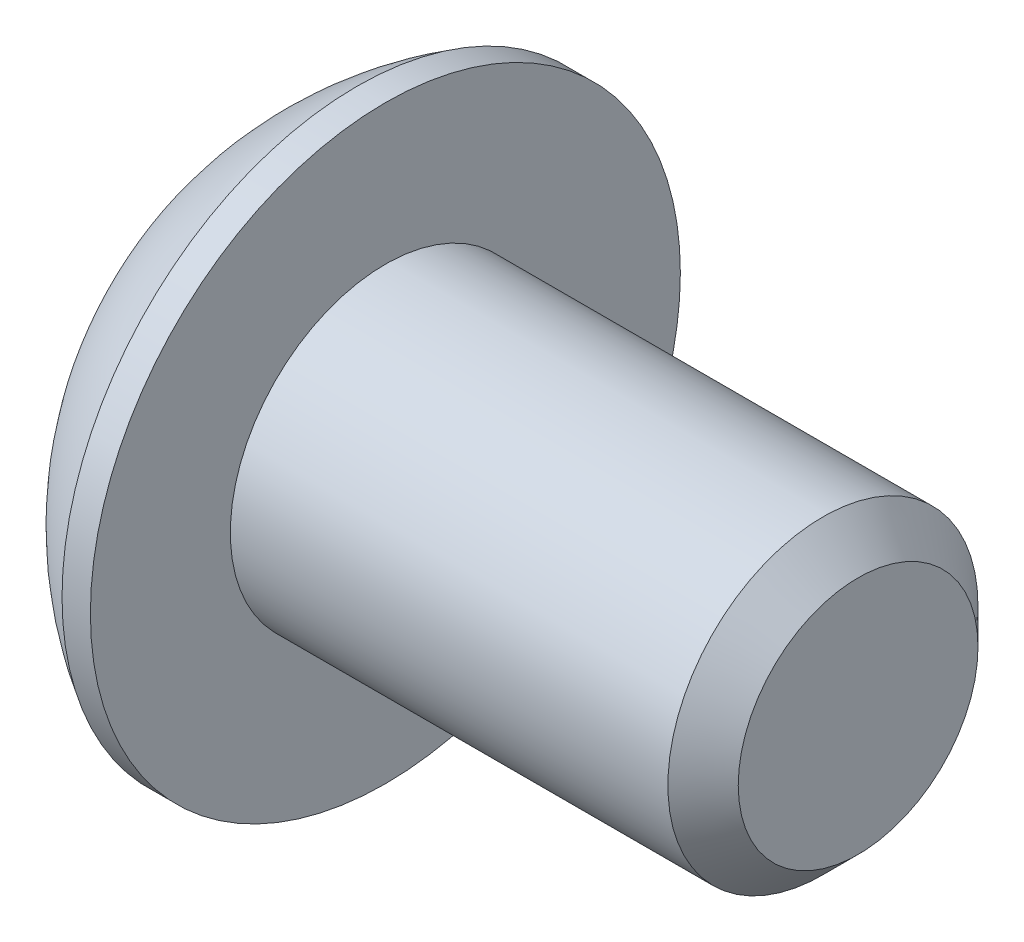
ISO-10303-21;
HEADER;
FILE_DESCRIPTION(('STEP AP214'),'2;1');
FILE_NAME('part.step','',(''),(''),'','','');
FILE_SCHEMA(('AUTOMOTIVE_DESIGN { 1 0 10303 214 1 1 1 1 }'));
ENDSEC;
DATA;
#1=APPLICATION_CONTEXT('core data for automotive mechanical design processes');
#2=APPLICATION_PROTOCOL_DEFINITION('international standard','automotive_design',2000,#1);
#3=PRODUCT_CONTEXT('',#1,'mechanical');
#4=PRODUCT('Part','Part','',(#3));
#5=PRODUCT_RELATED_PRODUCT_CATEGORY('part','',(#4));
#6=PRODUCT_DEFINITION_FORMATION('','',#4);
#7=PRODUCT_DEFINITION_CONTEXT('part definition',#1,'design');
#8=PRODUCT_DEFINITION('design','',#6,#7);
#9=PRODUCT_DEFINITION_SHAPE('','',#8);
#10=(LENGTH_UNIT() NAMED_UNIT(*) SI_UNIT(.MILLI.,.METRE.));
#11=(NAMED_UNIT(*) PLANE_ANGLE_UNIT() SI_UNIT($,.RADIAN.));
#12=(NAMED_UNIT(*) SI_UNIT($,.STERADIAN.) SOLID_ANGLE_UNIT());
#13=UNCERTAINTY_MEASURE_WITH_UNIT(LENGTH_MEASURE(1.E-05),#10,'distance_accuracy_value','');
#14=(GEOMETRIC_REPRESENTATION_CONTEXT(3) GLOBAL_UNCERTAINTY_ASSIGNED_CONTEXT((#13)) GLOBAL_UNIT_ASSIGNED_CONTEXT((#10,
#11,#12)) REPRESENTATION_CONTEXT('',''));
#15=CARTESIAN_POINT('',(0.,0.,0.));
#16=DIRECTION('',(0.,0.,1.));
#17=DIRECTION('',(1.,0.,0.));
#18=AXIS2_PLACEMENT_3D('',#15,#16,#17);
#19=CARTESIAN_POINT('',(8.55980000000001,0.,0.));
#20=DIRECTION('',(-1.,0.,0.));
#21=DIRECTION('',(0.,0.,-1.));
#22=AXIS2_PLACEMENT_3D('',#19,#20,#21);
#23=PLANE('',#22);
#24=CARTESIAN_POINT('',(8.55979999994361,0.,0.));
#25=DIRECTION('',(1.,0.,0.));
#26=DIRECTION('',(0.,0.,-1.));
#27=AXIS2_PLACEMENT_3D('',#24,#25,#26);
#28=CIRCLE('',#27,1.61036000008604);
#29=CARTESIAN_POINT('',(8.55979999994361,0.,-1.61036000008608));
#30=VERTEX_POINT('',#29);
#31=EDGE_CURVE('E41',#30,#30,#28,.T.);
#32=ORIENTED_EDGE('',*,*,#31,.T.);
#33=EDGE_LOOP('',(#32));
#34=FACE_BOUND('',#33,.T.);
#35=ADVANCED_FACE('F37',(#34),#23,.F.);
#36=CARTESIAN_POINT('',(8.08735999999044,0.,0.));
#37=DIRECTION('',(-1.,0.,0.));
#38=DIRECTION('',(0.,0.,-1.));
#39=AXIS2_PLACEMENT_3D('',#36,#37,#38);
#40=CONICAL_SURFACE('',#39,2.08280000003921,0.785398163397448);
#41=ORIENTED_EDGE('',*,*,#31,.F.);
#42=EDGE_LOOP('',(#41));
#43=FACE_BOUND('',#42,.T.);
#44=CARTESIAN_POINT('',(8.08735999999999,0.,0.));
#45=DIRECTION('',(1.,0.,0.));
#46=DIRECTION('',(0.,0.,-1.));
#47=AXIS2_PLACEMENT_3D('',#44,#45,#46);
#48=CIRCLE('',#47,2.08280000000002);
#49=CARTESIAN_POINT('',(8.08735999999999,0.,-2.08280000000002));
#50=VERTEX_POINT('',#49);
#51=EDGE_CURVE('E145',#50,#50,#48,.T.);
#52=ORIENTED_EDGE('',*,*,#51,.T.);
#53=EDGE_LOOP('',(#52));
#54=FACE_BOUND('',#53,.T.);
#55=ADVANCED_FACE('F294',(#43,#54),#40,.T.);
#56=CARTESIAN_POINT('',(1.32079999991674,0.,0.));
#57=DIRECTION('',(-1.,0.,0.));
#58=DIRECTION('',(0.,0.,-1.));
#59=AXIS2_PLACEMENT_3D('',#56,#57,#58);
#60=CONICAL_SURFACE('',#59,1.19380000000998,1.04719755121067);
#61=CARTESIAN_POINT('',(2.01004075125866,0.,0.));
#62=VERTEX_POINT('',#61);
#63=VERTEX_LOOP('',#62);
#64=FACE_BOUND('',#63,.T.);
#65=CARTESIAN_POINT('',(1.32079999991674,0.,0.));
#66=DIRECTION('',(1.,0.,0.));
#67=DIRECTION('',(0.,0.,-1.));
#68=AXIS2_PLACEMENT_3D('',#65,#66,#67);
#69=CIRCLE('',#68,1.19380000000998);
#70=CARTESIAN_POINT('',(1.32079999995841,-1.03386112704217,-0.596900000002525));
#71=VERTEX_POINT('',#70);
#72=CARTESIAN_POINT('',(1.32079999995191,0.,-1.19379999997911));
#73=VERTEX_POINT('',#72);
#74=EDGE_CURVE('E139',#71,#73,#69,.T.);
#75=ORIENTED_EDGE('',*,*,#74,.F.);
#76=CARTESIAN_POINT('',(1.32079999991674,0.,0.));
#77=DIRECTION('',(1.,0.,0.));
#78=DIRECTION('',(0.,0.,-1.));
#79=AXIS2_PLACEMENT_3D('',#76,#77,#78);
#80=CIRCLE('',#79,1.19380000000998);
#81=CARTESIAN_POINT('',(1.3207999999586,-1.03386112704217,0.596900000002466));
#82=VERTEX_POINT('',#81);
#83=EDGE_CURVE('E150',#82,#71,#80,.T.);
#84=ORIENTED_EDGE('',*,*,#83,.F.);
#85=CARTESIAN_POINT('',(1.32079999991674,0.,0.));
#86=DIRECTION('',(1.,0.,0.));
#87=DIRECTION('',(0.,0.,-1.));
#88=AXIS2_PLACEMENT_3D('',#85,#86,#87);
#89=CIRCLE('',#88,1.19380000000998);
#90=CARTESIAN_POINT('',(1.32079999995838,1.49000099134676E-12,1.19380000000498));
#91=VERTEX_POINT('',#90);
#92=EDGE_CURVE('E153',#91,#82,#89,.T.);
#93=ORIENTED_EDGE('',*,*,#92,.F.);
#94=CARTESIAN_POINT('',(1.32079999991674,0.,0.));
#95=DIRECTION('',(1.,0.,0.));
#96=DIRECTION('',(0.,0.,-1.));
#97=AXIS2_PLACEMENT_3D('',#94,#95,#96);
#98=CIRCLE('',#97,1.19380000000998);
#99=CARTESIAN_POINT('',(1.3207999999586,1.03386112704219,0.596900000002484));
#100=VERTEX_POINT('',#99);
#101=EDGE_CURVE('E144',#100,#91,#98,.T.);
#102=ORIENTED_EDGE('',*,*,#101,.F.);
#103=CARTESIAN_POINT('',(1.32079999991674,0.,0.));
#104=DIRECTION('',(1.,0.,0.));
#105=DIRECTION('',(0.,0.,-1.));
#106=AXIS2_PLACEMENT_3D('',#103,#104,#105);
#107=CIRCLE('',#106,1.19380000000998);
#108=CARTESIAN_POINT('',(1.32079999995841,1.03386112704219,-0.596900000002536));
#109=VERTEX_POINT('',#108);
#110=EDGE_CURVE('E126',#109,#100,#107,.T.);
#111=ORIENTED_EDGE('',*,*,#110,.F.);
#112=CARTESIAN_POINT('',(1.32079999991674,0.,0.));
#113=DIRECTION('',(1.,0.,0.));
#114=DIRECTION('',(0.,0.,-1.));
#115=AXIS2_PLACEMENT_3D('',#112,#113,#114);
#116=CIRCLE('',#115,1.19380000000998);
#117=EDGE_CURVE('E133',#73,#109,#116,.T.);
#118=ORIENTED_EDGE('',*,*,#117,.F.);
#119=EDGE_LOOP('',(#75,#84,#93,#102,#111,#118));
#120=FACE_BOUND('',#119,.T.);
#121=ADVANCED_FACE('F141',(#64,#120),#60,.F.);
#122=CARTESIAN_POINT('',(0.,0.,0.));
#123=DIRECTION('',(-1.,0.,0.));
#124=DIRECTION('',(0.,0.,-1.));
#125=AXIS2_PLACEMENT_3D('',#122,#123,#124);
#126=CYLINDRICAL_SURFACE('',#125,2.08280000000002);
#127=ORIENTED_EDGE('',*,*,#51,.F.);
#128=EDGE_LOOP('',(#127));
#129=FACE_BOUND('',#128,.T.);
#130=CARTESIAN_POINT('',(2.20979999999998,0.,0.));
#131=DIRECTION('',(1.,0.,0.));
#132=DIRECTION('',(0.,0.,-1.));
#133=AXIS2_PLACEMENT_3D('',#130,#131,#132);
#134=CIRCLE('',#133,2.08280000000002);
#135=CARTESIAN_POINT('',(2.20979999999998,0.,-2.08280000000002));
#136=VERTEX_POINT('',#135);
#137=EDGE_CURVE('E157',#136,#136,#134,.F.);
#138=ORIENTED_EDGE('',*,*,#137,.F.);
#139=EDGE_LOOP('',(#138));
#140=FACE_BOUND('',#139,.T.);
#141=ADVANCED_FACE('F305',(#129,#140),#126,.T.);
#142=CARTESIAN_POINT('',(1.32080000000001,-2.06772225407572,1.19379999999998));
#143=DIRECTION('',(1.,0.,0.));
#144=DIRECTION('',(0.,0.,1.));
#145=AXIS2_PLACEMENT_3D('',#142,#143,#144);
#146=PLANE('',#145);
#147=DIRECTION('',(0.,-0.5,0.866025403784439));
#148=VECTOR('',#147,1.);
#149=CARTESIAN_POINT('',(1.32080000000045,1.37848150271718,0.));
#150=LINE('',#149,#148);
#151=CARTESIAN_POINT('',(1.32080000000016,1.37848150271718,0.));
#152=VERTEX_POINT('',#151);
#153=EDGE_CURVE('E129',#100,#152,#150,.F.);
#154=ORIENTED_EDGE('',*,*,#153,.T.);
#155=DIRECTION('',(0.,0.5,0.866025403784438));
#156=VECTOR('',#155,1.);
#157=CARTESIAN_POINT('',(1.32080000000001,0.68924075135858,-1.19380000000002));
#158=LINE('',#157,#156);
#159=EDGE_CURVE('E112',#152,#109,#158,.F.);
#160=ORIENTED_EDGE('',*,*,#159,.T.);
#161=ORIENTED_EDGE('',*,*,#110,.T.);
#162=EDGE_LOOP('',(#154,#160,#161));
#163=FACE_BOUND('',#162,.T.);
#164=ADVANCED_FACE('F124',(#163),#146,.F.);
#165=CARTESIAN_POINT('',(1.32080000000001,-2.06772225407572,1.19379999999998));
#166=DIRECTION('',(1.,0.,0.));
#167=DIRECTION('',(0.,0.,1.));
#168=AXIS2_PLACEMENT_3D('',#165,#166,#167);
#169=PLANE('',#168);
#170=DIRECTION('',(0.,0.5,0.866025403784438));
#171=VECTOR('',#170,1.);
#172=CARTESIAN_POINT('',(1.32080000000007,0.68924075135858,-1.19380000000002));
#173=LINE('',#172,#171);
#174=CARTESIAN_POINT('',(1.32080000000028,0.6892407513586,-1.19380000000003));
#175=VERTEX_POINT('',#174);
#176=EDGE_CURVE('E108',#109,#175,#173,.F.);
#177=ORIENTED_EDGE('',*,*,#176,.T.);
#178=DIRECTION('',(0.,1.,0.));
#179=VECTOR('',#178,1.);
#180=CARTESIAN_POINT('',(1.32080000000051,-0.689240751358577,-1.19380000000003));
#181=LINE('',#180,#179);
#182=EDGE_CURVE('E135',#175,#73,#181,.F.);
#183=ORIENTED_EDGE('',*,*,#182,.T.);
#184=ORIENTED_EDGE('',*,*,#117,.T.);
#185=EDGE_LOOP('',(#177,#183,#184));
#186=FACE_BOUND('',#185,.T.);
#187=ADVANCED_FACE('F134',(#186),#169,.F.);
#188=CARTESIAN_POINT('',(1.32080000000001,-2.06772225407572,1.19379999999998));
#189=DIRECTION('',(1.,0.,0.));
#190=DIRECTION('',(0.,0.,1.));
#191=AXIS2_PLACEMENT_3D('',#188,#189,#190);
#192=PLANE('',#191);
#193=DIRECTION('',(0.,1.,0.));
#194=VECTOR('',#193,1.);
#195=CARTESIAN_POINT('',(1.32080000000057,-0.689240751358577,-1.19380000000003));
#196=LINE('',#195,#194);
#197=CARTESIAN_POINT('',(1.32080000000045,-0.689240751358574,-1.19380000000003));
#198=VERTEX_POINT('',#197);
#199=EDGE_CURVE('E193',#73,#198,#196,.F.);
#200=ORIENTED_EDGE('',*,*,#199,.T.);
#201=DIRECTION('',(0.,0.5,-0.866025403784439));
#202=VECTOR('',#201,1.);
#203=CARTESIAN_POINT('',(1.32080000000051,-1.37848150271714,0.));
#204=LINE('',#203,#202);
#205=EDGE_CURVE('E207',#198,#71,#204,.F.);
#206=ORIENTED_EDGE('',*,*,#205,.T.);
#207=ORIENTED_EDGE('',*,*,#74,.T.);
#208=EDGE_LOOP('',(#200,#206,#207));
#209=FACE_BOUND('',#208,.T.);
#210=ADVANCED_FACE('F314',(#209),#192,.F.);
#211=CARTESIAN_POINT('',(1.32080000000001,-2.06772225407572,1.19379999999998));
#212=DIRECTION('',(1.,0.,0.));
#213=DIRECTION('',(0.,0.,1.));
#214=AXIS2_PLACEMENT_3D('',#211,#212,#213);
#215=PLANE('',#214);
#216=DIRECTION('',(0.,0.5,-0.866025403784439));
#217=VECTOR('',#216,1.);
#218=CARTESIAN_POINT('',(1.32080000000007,-1.37848150271714,0.));
#219=LINE('',#218,#217);
#220=CARTESIAN_POINT('',(1.32080000000003,-1.37848150271713,0.));
#221=VERTEX_POINT('',#220);
#222=EDGE_CURVE('E212',#71,#221,#219,.F.);
#223=ORIENTED_EDGE('',*,*,#222,.T.);
#224=DIRECTION('',(0.,-0.5,-0.866025403784439));
#225=VECTOR('',#224,1.);
#226=CARTESIAN_POINT('',(1.32080000000001,-0.689240751358577,1.19379999999997));
#227=LINE('',#226,#225);
#228=EDGE_CURVE('E226',#221,#82,#227,.F.);
#229=ORIENTED_EDGE('',*,*,#228,.T.);
#230=ORIENTED_EDGE('',*,*,#83,.T.);
#231=EDGE_LOOP('',(#223,#229,#230));
#232=FACE_BOUND('',#231,.T.);
#233=ADVANCED_FACE('F273',(#232),#215,.F.);
#234=CARTESIAN_POINT('',(1.32080000000001,-2.06772225407572,1.19379999999998));
#235=DIRECTION('',(1.,0.,0.));
#236=DIRECTION('',(0.,0.,1.));
#237=AXIS2_PLACEMENT_3D('',#234,#235,#236);
#238=PLANE('',#237);
#239=DIRECTION('',(0.,-0.5,-0.866025403784439));
#240=VECTOR('',#239,1.);
#241=CARTESIAN_POINT('',(1.32080000000045,-0.689240751358577,1.19379999999997));
#242=LINE('',#241,#240);
#243=CARTESIAN_POINT('',(1.32080000000016,-0.689240751358563,1.19379999999999));
#244=VERTEX_POINT('',#243);
#245=EDGE_CURVE('E231',#82,#244,#242,.F.);
#246=ORIENTED_EDGE('',*,*,#245,.T.);
#247=DIRECTION('',(0.,1.,0.));
#248=VECTOR('',#247,1.);
#249=CARTESIAN_POINT('',(1.32080000000001,0.689240751358615,1.19380000000001));
#250=LINE('',#249,#248);
#251=EDGE_CURVE('E247',#244,#91,#250,.T.);
#252=ORIENTED_EDGE('',*,*,#251,.T.);
#253=ORIENTED_EDGE('',*,*,#92,.T.);
#254=EDGE_LOOP('',(#246,#252,#253));
#255=FACE_BOUND('',#254,.T.);
#256=ADVANCED_FACE('F266',(#255),#238,.F.);
#257=CARTESIAN_POINT('',(1.32080000000001,-2.06772225407572,1.19379999999998));
#258=DIRECTION('',(1.,0.,0.));
#259=DIRECTION('',(0.,0.,1.));
#260=AXIS2_PLACEMENT_3D('',#257,#258,#259);
#261=PLANE('',#260);
#262=DIRECTION('',(0.,1.,0.));
#263=VECTOR('',#262,1.);
#264=CARTESIAN_POINT('',(1.32080000000001,0.689240751358615,1.19380000000001));
#265=LINE('',#264,#263);
#266=CARTESIAN_POINT('',(1.32080000000001,0.689240751358576,1.19380000000002));
#267=VERTEX_POINT('',#266);
#268=EDGE_CURVE('E256',#91,#267,#265,.T.);
#269=ORIENTED_EDGE('',*,*,#268,.T.);
#270=DIRECTION('',(0.,-0.5,0.866025403784439));
#271=VECTOR('',#270,1.);
#272=CARTESIAN_POINT('',(1.32080000000001,1.37848150271718,0.));
#273=LINE('',#272,#271);
#274=EDGE_CURVE('E160',#267,#100,#273,.F.);
#275=ORIENTED_EDGE('',*,*,#274,.T.);
#276=ORIENTED_EDGE('',*,*,#101,.T.);
#277=EDGE_LOOP('',(#269,#275,#276));
#278=FACE_BOUND('',#277,.T.);
#279=ADVANCED_FACE('F270',(#278),#261,.F.);
#280=CARTESIAN_POINT('',(2.20979999999998,2.08280000000001,0.));
#281=DIRECTION('',(-1.,0.,0.));
#282=DIRECTION('',(0.,0.,-1.));
#283=AXIS2_PLACEMENT_3D('',#280,#281,#282);
#284=PLANE('',#283);
#285=CARTESIAN_POINT('',(2.20979999999998,0.,0.));
#286=DIRECTION('',(1.,0.,0.));
#287=DIRECTION('',(0.,0.,-1.));
#288=AXIS2_PLACEMENT_3D('',#285,#286,#287);
#289=CIRCLE('',#288,3.96240000000004);
#290=CARTESIAN_POINT('',(2.20979999999998,0.,-3.96240000000004));
#291=VERTEX_POINT('',#290);
#292=EDGE_CURVE('E161',#291,#291,#289,.T.);
#293=ORIENTED_EDGE('',*,*,#292,.T.);
#294=EDGE_LOOP('',(#293));
#295=FACE_BOUND('',#294,.T.);
#296=ORIENTED_EDGE('',*,*,#137,.T.);
#297=EDGE_LOOP('',(#296));
#298=FACE_BOUND('',#297,.T.);
#299=ADVANCED_FACE('F283',(#295,#298),#284,.F.);
#300=CARTESIAN_POINT('',(1.32080000000001,1.37848150271718,0.));
#301=DIRECTION('',(0.,-0.866025403784439,-0.5));
#302=DIRECTION('',(0.,-0.5,0.866025403784439));
#303=AXIS2_PLACEMENT_3D('',#300,#301,#302);
#304=PLANE('',#303);
#305=ORIENTED_EDGE('',*,*,#153,.F.);
#306=ORIENTED_EDGE('',*,*,#274,.F.);
#307=DIRECTION('',(1.,0.,0.));
#308=VECTOR('',#307,1.);
#309=CARTESIAN_POINT('',(1.32080000000001,0.689240751358594,1.19380000000001));
#310=LINE('',#309,#308);
#311=CARTESIAN_POINT('',(0.,0.689240751358589,1.19380000000001));
#312=VERTEX_POINT('',#311);
#313=EDGE_CURVE('E165',#267,#312,#310,.F.);
#314=ORIENTED_EDGE('',*,*,#313,.T.);
#315=DIRECTION('',(0.,0.499999999999998,-0.86602540378444));
#316=VECTOR('',#315,1.);
#317=CARTESIAN_POINT('',(0.,0.689240751358606,1.19380000000002));
#318=LINE('',#317,#316);
#319=CARTESIAN_POINT('',(0.,1.37848150271718,0.));
#320=VERTEX_POINT('',#319);
#321=EDGE_CURVE('E164',#312,#320,#318,.T.);
#322=ORIENTED_EDGE('',*,*,#321,.T.);
#323=DIRECTION('',(1.,0.,0.));
#324=VECTOR('',#323,1.);
#325=CARTESIAN_POINT('',(1.32080000000051,1.37848150271717,0.));
#326=LINE('',#325,#324);
#327=EDGE_CURVE('E130',#320,#152,#326,.T.);
#328=ORIENTED_EDGE('',*,*,#327,.T.);
#329=EDGE_LOOP('',(#305,#306,#314,#322,#328));
#330=FACE_BOUND('',#329,.T.);
#331=ADVANCED_FACE('F281',(#330),#304,.T.);
#332=CARTESIAN_POINT('',(1.32080000000051,0.68924075135858,-1.19380000000002));
#333=DIRECTION('',(0.,-0.866025403784438,0.5));
#334=DIRECTION('',(0.,0.5,0.866025403784438));
#335=AXIS2_PLACEMENT_3D('',#332,#333,#334);
#336=PLANE('',#335);
#337=ORIENTED_EDGE('',*,*,#176,.F.);
#338=ORIENTED_EDGE('',*,*,#159,.F.);
#339=ORIENTED_EDGE('',*,*,#327,.F.);
#340=DIRECTION('',(0.,-0.5,-0.866025403784439));
#341=VECTOR('',#340,1.);
#342=CARTESIAN_POINT('',(0.,1.37848150271719,0.));
#343=LINE('',#342,#341);
#344=CARTESIAN_POINT('',(1.87350135405495E-13,0.689240751358602,-1.19380000000002));
#345=VERTEX_POINT('',#344);
#346=EDGE_CURVE('E172',#320,#345,#343,.T.);
#347=ORIENTED_EDGE('',*,*,#346,.T.);
#348=DIRECTION('',(1.,0.,0.));
#349=VECTOR('',#348,1.);
#350=CARTESIAN_POINT('',(1.32080000000051,0.68924075135861,-1.19380000000003));
#351=LINE('',#350,#349);
#352=EDGE_CURVE('E116',#345,#175,#351,.T.);
#353=ORIENTED_EDGE('',*,*,#352,.T.);
#354=EDGE_LOOP('',(#337,#338,#339,#347,#353));
#355=FACE_BOUND('',#354,.T.);
#356=ADVANCED_FACE('F110',(#355),#336,.T.);
#357=CARTESIAN_POINT('',(1.32080000000051,-0.689240751358577,-1.19380000000003));
#358=DIRECTION('',(0.,0.,1.));
#359=DIRECTION('',(0.,1.,0.));
#360=AXIS2_PLACEMENT_3D('',#357,#358,#359);
#361=PLANE('',#360);
#362=ORIENTED_EDGE('',*,*,#199,.F.);
#363=ORIENTED_EDGE('',*,*,#182,.F.);
#364=ORIENTED_EDGE('',*,*,#352,.F.);
#365=DIRECTION('',(0.,1.,0.));
#366=VECTOR('',#365,1.);
#367=CARTESIAN_POINT('',(0.,0.,-1.19380000000001));
#368=LINE('',#367,#366);
#369=CARTESIAN_POINT('',(1.2490009027033E-13,-0.689240751358571,-1.19380000000003));
#370=VERTEX_POINT('',#369);
#371=EDGE_CURVE('E184',#345,#370,#368,.F.);
#372=ORIENTED_EDGE('',*,*,#371,.T.);
#373=DIRECTION('',(1.,0.,0.));
#374=VECTOR('',#373,1.);
#375=CARTESIAN_POINT('',(1.32080000000001,-0.689240751358573,-1.19380000000003));
#376=LINE('',#375,#374);
#377=EDGE_CURVE('E203',#370,#198,#376,.T.);
#378=ORIENTED_EDGE('',*,*,#377,.T.);
#379=EDGE_LOOP('',(#362,#363,#364,#372,#378));
#380=FACE_BOUND('',#379,.T.);
#381=ADVANCED_FACE('F289',(#380),#361,.T.);
#382=CARTESIAN_POINT('',(1.32080000000001,-1.37848150271714,0.));
#383=DIRECTION('',(0.,0.866025403784439,0.5));
#384=DIRECTION('',(0.,0.5,-0.866025403784439));
#385=AXIS2_PLACEMENT_3D('',#382,#383,#384);
#386=PLANE('',#385);
#387=ORIENTED_EDGE('',*,*,#222,.F.);
#388=ORIENTED_EDGE('',*,*,#205,.F.);
#389=ORIENTED_EDGE('',*,*,#377,.F.);
#390=DIRECTION('',(0.,-0.499999999999989,0.866025403784445));
#391=VECTOR('',#390,1.);
#392=CARTESIAN_POINT('',(0.,-0.689240751358566,-1.19380000000003));
#393=LINE('',#392,#391);
#394=CARTESIAN_POINT('',(0.,-1.37848150271714,0.));
#395=VERTEX_POINT('',#394);
#396=EDGE_CURVE('E198',#370,#395,#393,.T.);
#397=ORIENTED_EDGE('',*,*,#396,.T.);
#398=DIRECTION('',(1.,0.,0.));
#399=VECTOR('',#398,1.);
#400=CARTESIAN_POINT('',(1.32080000000001,-1.37848150271713,0.));
#401=LINE('',#400,#399);
#402=EDGE_CURVE('E222',#395,#221,#401,.T.);
#403=ORIENTED_EDGE('',*,*,#402,.T.);
#404=EDGE_LOOP('',(#387,#388,#389,#397,#403));
#405=FACE_BOUND('',#404,.T.);
#406=ADVANCED_FACE('F350',(#405),#386,.T.);
#407=CARTESIAN_POINT('',(1.32080000000001,-0.689240751358577,1.19379999999997));
#408=DIRECTION('',(0.,0.866025403784439,-0.5));
#409=DIRECTION('',(0.,-0.5,-0.866025403784439));
#410=AXIS2_PLACEMENT_3D('',#407,#408,#409);
#411=PLANE('',#410);
#412=ORIENTED_EDGE('',*,*,#245,.F.);
#413=ORIENTED_EDGE('',*,*,#228,.F.);
#414=ORIENTED_EDGE('',*,*,#402,.F.);
#415=DIRECTION('',(0.,0.50000000000001,0.866025403784433));
#416=VECTOR('',#415,1.);
#417=CARTESIAN_POINT('',(0.,-1.37848150271715,0.));
#418=LINE('',#417,#416);
#419=CARTESIAN_POINT('',(0.,-0.689240751358556,1.19380000000001));
#420=VERTEX_POINT('',#419);
#421=EDGE_CURVE('E217',#395,#420,#418,.T.);
#422=ORIENTED_EDGE('',*,*,#421,.T.);
#423=DIRECTION('',(1.,0.,0.));
#424=VECTOR('',#423,1.);
#425=CARTESIAN_POINT('',(1.32080000000001,-0.689240751358556,1.19380000000001));
#426=LINE('',#425,#424);
#427=EDGE_CURVE('E243',#420,#244,#426,.T.);
#428=ORIENTED_EDGE('',*,*,#427,.T.);
#429=EDGE_LOOP('',(#412,#413,#414,#422,#428));
#430=FACE_BOUND('',#429,.T.);
#431=ADVANCED_FACE('F277',(#430),#411,.T.);
#432=CARTESIAN_POINT('',(1.32080000000001,0.689240751358615,1.19380000000001));
#433=DIRECTION('',(0.,0.,-1.));
#434=DIRECTION('',(1.,0.,0.));
#435=AXIS2_PLACEMENT_3D('',#432,#433,#434);
#436=PLANE('',#435);
#437=ORIENTED_EDGE('',*,*,#268,.F.);
#438=ORIENTED_EDGE('',*,*,#251,.F.);
#439=ORIENTED_EDGE('',*,*,#427,.F.);
#440=DIRECTION('',(0.,1.,0.));
#441=VECTOR('',#440,1.);
#442=CARTESIAN_POINT('',(0.,0.,1.19380000000001));
#443=LINE('',#442,#441);
#444=EDGE_CURVE('E56',#420,#312,#443,.T.);
#445=ORIENTED_EDGE('',*,*,#444,.T.);
#446=ORIENTED_EDGE('',*,*,#313,.F.);
#447=EDGE_LOOP('',(#437,#438,#439,#445,#446));
#448=FACE_BOUND('',#447,.T.);
#449=ADVANCED_FACE('F278',(#448),#436,.T.);
#450=CARTESIAN_POINT('',(0.,0.,0.));
#451=DIRECTION('',(-1.,0.,0.));
#452=DIRECTION('',(0.,0.,-1.));
#453=AXIS2_PLACEMENT_3D('',#450,#451,#452);
#454=CYLINDRICAL_SURFACE('',#453,3.96240000000004);
#455=CARTESIAN_POINT('',(1.82880000000002,0.,0.));
#456=DIRECTION('',(1.,0.,0.));
#457=DIRECTION('',(0.,0.,-1.));
#458=AXIS2_PLACEMENT_3D('',#455,#456,#457);
#459=CIRCLE('',#458,3.96240000000004);
#460=CARTESIAN_POINT('',(1.82880000000002,0.,-3.96240000000004));
#461=VERTEX_POINT('',#460);
#462=EDGE_CURVE('E47',#461,#461,#459,.T.);
#463=ORIENTED_EDGE('',*,*,#462,.T.);
#464=EDGE_LOOP('',(#463));
#465=FACE_BOUND('',#464,.T.);
#466=ORIENTED_EDGE('',*,*,#292,.F.);
#467=EDGE_LOOP('',(#466));
#468=FACE_BOUND('',#467,.T.);
#469=ADVANCED_FACE('F377',(#465,#468),#454,.T.);
#470=CARTESIAN_POINT('',(0.,0.,0.));
#471=DIRECTION('',(-1.,0.,0.));
#472=DIRECTION('',(0.,0.,-1.));
#473=AXIS2_PLACEMENT_3D('',#470,#471,#472);
#474=PLANE('',#473);
#475=CARTESIAN_POINT('',(0.,0.,0.));
#476=DIRECTION('',(1.,0.,0.));
#477=DIRECTION('',(0.,0.,-1.));
#478=AXIS2_PLACEMENT_3D('',#475,#476,#477);
#479=CIRCLE('',#478,1.98120000000045);
#480=CARTESIAN_POINT('',(0.,0.,-1.98120000000042));
#481=VERTEX_POINT('',#480);
#482=EDGE_CURVE('E11',#481,#481,#479,.F.);
#483=ORIENTED_EDGE('',*,*,#482,.T.);
#484=EDGE_LOOP('',(#483));
#485=FACE_BOUND('',#484,.T.);
#486=ORIENTED_EDGE('',*,*,#421,.F.);
#487=ORIENTED_EDGE('',*,*,#396,.F.);
#488=ORIENTED_EDGE('',*,*,#371,.F.);
#489=ORIENTED_EDGE('',*,*,#346,.F.);
#490=ORIENTED_EDGE('',*,*,#321,.F.);
#491=ORIENTED_EDGE('',*,*,#444,.F.);
#492=EDGE_LOOP('',(#486,#487,#488,#489,#490,#491));
#493=FACE_BOUND('',#492,.T.);
#494=ADVANCED_FACE('F279',(#485,#493),#474,.T.);
#495=CARTESIAN_POINT('',(4.13384999999996,0.,0.));
#496=DIRECTION('',(0.,1.,0.));
#497=DIRECTION('',(-0.489667403954923,0.,0.8719093034852));
#498=AXIS2_PLACEMENT_3D('',#495,#496,#497);
#499=SPHERICAL_SURFACE('',#498,4.58408870578455);
#500=CARTESIAN_POINT('',(4.13384999999996,0.,0.));
#501=DIRECTION('',(1.,0.,0.));
#502=DIRECTION('',(0.,0.,-1.));
#503=AXIS2_PLACEMENT_3D('',#500,#501,#502);
#504=SPHERICAL_SURFACE('',#503,4.58408870578455);
#505=ORIENTED_EDGE('',*,*,#482,.F.);
#506=EDGE_LOOP('',(#505));
#507=FACE_BOUND('',#506,.T.);
#508=ORIENTED_EDGE('',*,*,#462,.F.);
#509=EDGE_LOOP('',(#508));
#510=FACE_BOUND('',#509,.T.);
#511=ADVANCED_FACE('F39',(#507,#510),#504,.T.);
#512=CLOSED_SHELL('',(#35,#55,#121,#141,#164,#187,#210,#233,#256,#279,#299,#331,#356,#381,#406,
#431,#449,#469,#494,#511));
#513=MANIFOLD_SOLID_BREP('B2',#512);
#514=ADVANCED_BREP_SHAPE_REPRESENTATION('',(#18,#513),#14);
#515=SHAPE_DEFINITION_REPRESENTATION(#9,#514);
ENDSEC;
END-ISO-10303-21;
